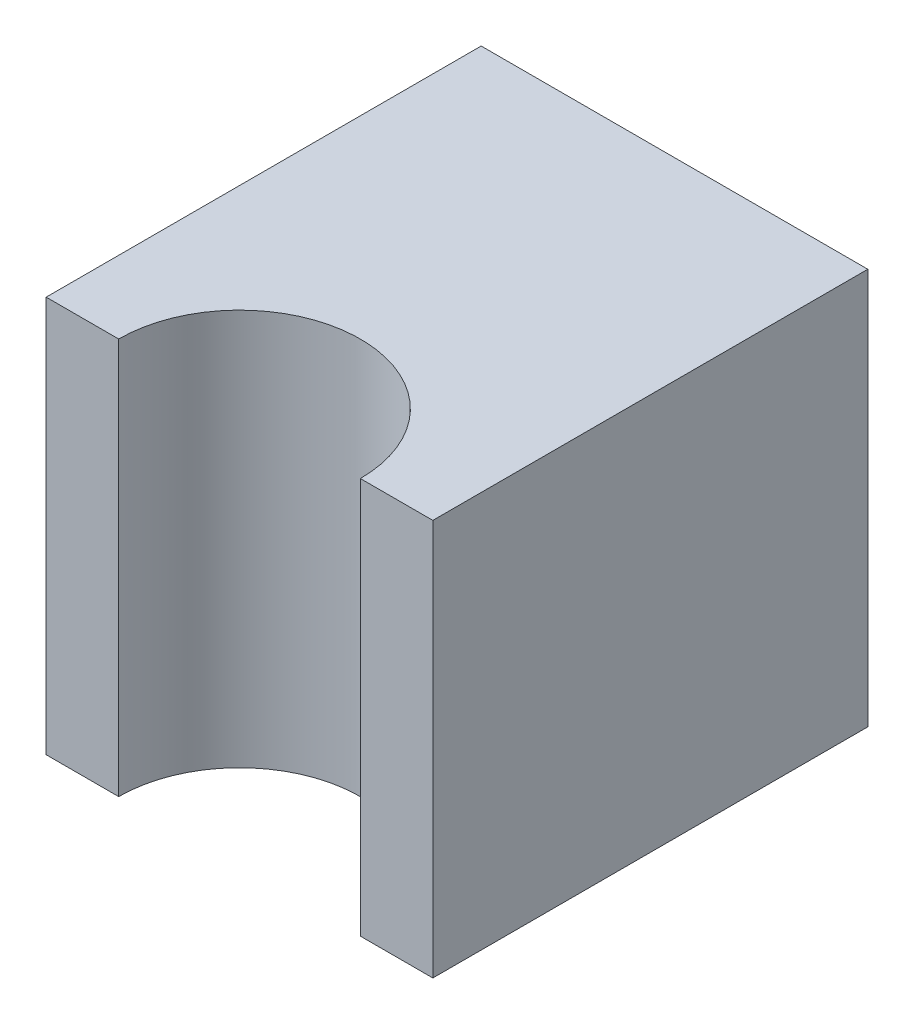
ISO-10303-21;
HEADER;
FILE_DESCRIPTION(('STEP AP214'),'2;1');
FILE_NAME('part.step','',(''),(''),'','','');
FILE_SCHEMA(('AUTOMOTIVE_DESIGN { 1 0 10303 214 1 1 1 1 }'));
ENDSEC;
DATA;
#1=APPLICATION_CONTEXT('core data for automotive mechanical design processes');
#2=APPLICATION_PROTOCOL_DEFINITION('international standard','automotive_design',2000,#1);
#3=PRODUCT_CONTEXT('',#1,'mechanical');
#4=PRODUCT('Part','Part','',(#3));
#5=PRODUCT_RELATED_PRODUCT_CATEGORY('part','',(#4));
#6=PRODUCT_DEFINITION_FORMATION('','',#4);
#7=PRODUCT_DEFINITION_CONTEXT('part definition',#1,'design');
#8=PRODUCT_DEFINITION('design','',#6,#7);
#9=PRODUCT_DEFINITION_SHAPE('','',#8);
#10=(LENGTH_UNIT() NAMED_UNIT(*) SI_UNIT(.MILLI.,.METRE.));
#11=(NAMED_UNIT(*) PLANE_ANGLE_UNIT() SI_UNIT($,.RADIAN.));
#12=(NAMED_UNIT(*) SI_UNIT($,.STERADIAN.) SOLID_ANGLE_UNIT());
#13=UNCERTAINTY_MEASURE_WITH_UNIT(LENGTH_MEASURE(1.E-05),#10,'distance_accuracy_value','');
#14=(GEOMETRIC_REPRESENTATION_CONTEXT(3) GLOBAL_UNCERTAINTY_ASSIGNED_CONTEXT((#13)) GLOBAL_UNIT_ASSIGNED_CONTEXT((#10,
#11,#12)) REPRESENTATION_CONTEXT('',''));
#15=CARTESIAN_POINT('',(0.,0.,0.));
#16=DIRECTION('',(0.,0.,1.));
#17=DIRECTION('',(1.,0.,0.));
#18=AXIS2_PLACEMENT_3D('',#15,#16,#17);
#19=CARTESIAN_POINT('',(1.75,0.,6.1));
#20=DIRECTION('',(0.,0.,1.));
#21=DIRECTION('',(1.,0.,0.));
#22=AXIS2_PLACEMENT_3D('',#19,#20,#21);
#23=PLANE('',#22);
#24=DIRECTION('',(1.,0.,0.));
#25=VECTOR('',#24,1.);
#26=CARTESIAN_POINT('',(1.5,0.82,6.1));
#27=LINE('',#26,#25);
#28=CARTESIAN_POINT('',(1.75,0.82,6.1));
#29=VERTEX_POINT('',#28);
#30=CARTESIAN_POINT('',(1.9,0.82,6.1));
#31=VERTEX_POINT('',#30);
#32=EDGE_CURVE('E76',#29,#31,#27,.T.);
#33=ORIENTED_EDGE('',*,*,#32,.F.);
#34=DIRECTION('',(0.,1.,0.));
#35=VECTOR('',#34,1.);
#36=CARTESIAN_POINT('',(1.75,0.,6.1));
#37=LINE('',#36,#35);
#38=CARTESIAN_POINT('',(1.75,0.,6.1));
#39=VERTEX_POINT('',#38);
#40=EDGE_CURVE('E72',#29,#39,#37,.F.);
#41=ORIENTED_EDGE('',*,*,#40,.T.);
#42=DIRECTION('',(1.,0.,0.));
#43=VECTOR('',#42,1.);
#44=CARTESIAN_POINT('',(1.5,0.,6.1));
#45=LINE('',#44,#43);
#46=CARTESIAN_POINT('',(1.9,0.,6.1));
#47=VERTEX_POINT('',#46);
#48=EDGE_CURVE('E73',#39,#47,#45,.T.);
#49=ORIENTED_EDGE('',*,*,#48,.T.);
#50=DIRECTION('',(0.,1.,0.));
#51=VECTOR('',#50,1.);
#52=CARTESIAN_POINT('',(1.9,0.,6.1));
#53=LINE('',#52,#51);
#54=EDGE_CURVE('E80',#31,#47,#53,.F.);
#55=ORIENTED_EDGE('',*,*,#54,.F.);
#56=EDGE_LOOP('',(#33,#41,#49,#55));
#57=FACE_BOUND('',#56,.T.);
#58=ADVANCED_FACE('F17',(#57),#23,.T.);
#59=CARTESIAN_POINT('',(1.5,0.,6.1));
#60=DIRECTION('',(0.,1.,0.));
#61=DIRECTION('',(0.,0.,1.));
#62=AXIS2_PLACEMENT_3D('',#59,#60,#61);
#63=CYLINDRICAL_SURFACE('',#62,0.25);
#64=ORIENTED_EDGE('',*,*,#40,.F.);
#65=CARTESIAN_POINT('',(1.5,0.82,6.1));
#66=DIRECTION('',(0.,1.,0.));
#67=DIRECTION('',(0.,0.,1.));
#68=AXIS2_PLACEMENT_3D('',#65,#66,#67);
#69=CIRCLE('',#68,0.25);
#70=CARTESIAN_POINT('',(1.25,0.82,6.1));
#71=VERTEX_POINT('',#70);
#72=EDGE_CURVE('E129',#71,#29,#69,.F.);
#73=ORIENTED_EDGE('',*,*,#72,.F.);
#74=DIRECTION('',(0.,1.,0.));
#75=VECTOR('',#74,1.);
#76=CARTESIAN_POINT('',(1.25,0.,6.1));
#77=LINE('',#76,#75);
#78=CARTESIAN_POINT('',(1.25,0.,6.1));
#79=VERTEX_POINT('',#78);
#80=EDGE_CURVE('E83',#79,#71,#77,.T.);
#81=ORIENTED_EDGE('',*,*,#80,.F.);
#82=CARTESIAN_POINT('',(1.5,0.,6.1));
#83=DIRECTION('',(0.,1.,0.));
#84=DIRECTION('',(0.,0.,1.));
#85=AXIS2_PLACEMENT_3D('',#82,#83,#84);
#86=CIRCLE('',#85,0.25);
#87=EDGE_CURVE('E20',#79,#39,#86,.F.);
#88=ORIENTED_EDGE('',*,*,#87,.T.);
#89=EDGE_LOOP('',(#64,#73,#81,#88));
#90=FACE_BOUND('',#89,.T.);
#91=ADVANCED_FACE('F82',(#90),#63,.F.);
#92=CARTESIAN_POINT('',(1.9,0.,6.1));
#93=DIRECTION('',(1.,0.,0.));
#94=DIRECTION('',(0.,0.,-1.));
#95=AXIS2_PLACEMENT_3D('',#92,#93,#94);
#96=PLANE('',#95);
#97=DIRECTION('',(0.,0.,1.));
#98=VECTOR('',#97,1.);
#99=CARTESIAN_POINT('',(1.9,0.82,5.65));
#100=LINE('',#99,#98);
#101=CARTESIAN_POINT('',(1.9,0.82,5.2));
#102=VERTEX_POINT('',#101);
#103=EDGE_CURVE('E108',#31,#102,#100,.F.);
#104=ORIENTED_EDGE('',*,*,#103,.F.);
#105=ORIENTED_EDGE('',*,*,#54,.T.);
#106=DIRECTION('',(0.,0.,1.));
#107=VECTOR('',#106,1.);
#108=CARTESIAN_POINT('',(1.9,0.,5.65));
#109=LINE('',#108,#107);
#110=CARTESIAN_POINT('',(1.9,0.,5.2));
#111=VERTEX_POINT('',#110);
#112=EDGE_CURVE('E85',#47,#111,#109,.F.);
#113=ORIENTED_EDGE('',*,*,#112,.T.);
#114=DIRECTION('',(0.,1.,0.));
#115=VECTOR('',#114,1.);
#116=CARTESIAN_POINT('',(1.9,0.,5.2));
#117=LINE('',#116,#115);
#118=EDGE_CURVE('E120',#102,#111,#117,.F.);
#119=ORIENTED_EDGE('',*,*,#118,.F.);
#120=EDGE_LOOP('',(#104,#105,#113,#119));
#121=FACE_BOUND('',#120,.T.);
#122=ADVANCED_FACE('F144',(#121),#96,.T.);
#123=CARTESIAN_POINT('',(1.5,0.,5.65));
#124=DIRECTION('',(0.,1.,0.));
#125=DIRECTION('',(0.,0.,1.));
#126=AXIS2_PLACEMENT_3D('',#123,#124,#125);
#127=PLANE('',#126);
#128=ORIENTED_EDGE('',*,*,#87,.F.);
#129=DIRECTION('',(1.,0.,0.));
#130=VECTOR('',#129,1.);
#131=CARTESIAN_POINT('',(1.1,0.,6.1));
#132=LINE('',#131,#130);
#133=CARTESIAN_POINT('',(1.1,0.,6.1));
#134=VERTEX_POINT('',#133);
#135=EDGE_CURVE('E88',#134,#79,#132,.T.);
#136=ORIENTED_EDGE('',*,*,#135,.F.);
#137=DIRECTION('',(0.,0.,1.));
#138=VECTOR('',#137,1.);
#139=CARTESIAN_POINT('',(1.1,0.,5.2));
#140=LINE('',#139,#138);
#141=CARTESIAN_POINT('',(1.1,0.,5.2));
#142=VERTEX_POINT('',#141);
#143=EDGE_CURVE('E105',#142,#134,#140,.T.);
#144=ORIENTED_EDGE('',*,*,#143,.F.);
#145=DIRECTION('',(-1.,0.,0.));
#146=VECTOR('',#145,1.);
#147=CARTESIAN_POINT('',(1.9,0.,5.2));
#148=LINE('',#147,#146);
#149=EDGE_CURVE('E126',#111,#142,#148,.T.);
#150=ORIENTED_EDGE('',*,*,#149,.F.);
#151=ORIENTED_EDGE('',*,*,#112,.F.);
#152=ORIENTED_EDGE('',*,*,#48,.F.);
#153=EDGE_LOOP('',(#128,#136,#144,#150,#151,#152));
#154=FACE_BOUND('',#153,.T.);
#155=ADVANCED_FACE('F86',(#154),#127,.F.);
#156=CARTESIAN_POINT('',(1.1,0.,6.1));
#157=DIRECTION('',(0.,0.,1.));
#158=DIRECTION('',(1.,0.,0.));
#159=AXIS2_PLACEMENT_3D('',#156,#157,#158);
#160=PLANE('',#159);
#161=DIRECTION('',(1.,0.,0.));
#162=VECTOR('',#161,1.);
#163=CARTESIAN_POINT('',(1.5,0.82,6.1));
#164=LINE('',#163,#162);
#165=CARTESIAN_POINT('',(1.1,0.82,6.1));
#166=VERTEX_POINT('',#165);
#167=EDGE_CURVE('E110',#166,#71,#164,.T.);
#168=ORIENTED_EDGE('',*,*,#167,.F.);
#169=DIRECTION('',(0.,1.,0.));
#170=VECTOR('',#169,1.);
#171=CARTESIAN_POINT('',(1.1,0.,6.1));
#172=LINE('',#171,#170);
#173=EDGE_CURVE('E100',#134,#166,#172,.T.);
#174=ORIENTED_EDGE('',*,*,#173,.F.);
#175=ORIENTED_EDGE('',*,*,#135,.T.);
#176=ORIENTED_EDGE('',*,*,#80,.T.);
#177=EDGE_LOOP('',(#168,#174,#175,#176));
#178=FACE_BOUND('',#177,.T.);
#179=ADVANCED_FACE('F151',(#178),#160,.T.);
#180=CARTESIAN_POINT('',(1.5,0.82,5.65));
#181=DIRECTION('',(0.,1.,0.));
#182=DIRECTION('',(0.,0.,1.));
#183=AXIS2_PLACEMENT_3D('',#180,#181,#182);
#184=PLANE('',#183);
#185=ORIENTED_EDGE('',*,*,#167,.T.);
#186=ORIENTED_EDGE('',*,*,#72,.T.);
#187=ORIENTED_EDGE('',*,*,#32,.T.);
#188=ORIENTED_EDGE('',*,*,#103,.T.);
#189=DIRECTION('',(-1.,0.,0.));
#190=VECTOR('',#189,1.);
#191=CARTESIAN_POINT('',(1.9,0.82,5.2));
#192=LINE('',#191,#190);
#193=CARTESIAN_POINT('',(1.1,0.82,5.2));
#194=VERTEX_POINT('',#193);
#195=EDGE_CURVE('E35',#194,#102,#192,.F.);
#196=ORIENTED_EDGE('',*,*,#195,.F.);
#197=DIRECTION('',(0.,0.,1.));
#198=VECTOR('',#197,1.);
#199=CARTESIAN_POINT('',(1.1,0.82,5.2));
#200=LINE('',#199,#198);
#201=EDGE_CURVE('E26',#166,#194,#200,.F.);
#202=ORIENTED_EDGE('',*,*,#201,.F.);
#203=EDGE_LOOP('',(#185,#186,#187,#188,#196,#202));
#204=FACE_BOUND('',#203,.T.);
#205=ADVANCED_FACE('F140',(#204),#184,.T.);
#206=CARTESIAN_POINT('',(1.9,0.,5.2));
#207=DIRECTION('',(0.,0.,-1.));
#208=DIRECTION('',(-1.,0.,0.));
#209=AXIS2_PLACEMENT_3D('',#206,#207,#208);
#210=PLANE('',#209);
#211=ORIENTED_EDGE('',*,*,#195,.T.);
#212=ORIENTED_EDGE('',*,*,#118,.T.);
#213=ORIENTED_EDGE('',*,*,#149,.T.);
#214=DIRECTION('',(0.,1.,0.));
#215=VECTOR('',#214,1.);
#216=CARTESIAN_POINT('',(1.1,0.,5.2));
#217=LINE('',#216,#215);
#218=EDGE_CURVE('E11',#194,#142,#217,.F.);
#219=ORIENTED_EDGE('',*,*,#218,.F.);
#220=EDGE_LOOP('',(#211,#212,#213,#219));
#221=FACE_BOUND('',#220,.T.);
#222=ADVANCED_FACE('F146',(#221),#210,.T.);
#223=CARTESIAN_POINT('',(1.1,0.,5.2));
#224=DIRECTION('',(-1.,0.,0.));
#225=DIRECTION('',(0.,0.,1.));
#226=AXIS2_PLACEMENT_3D('',#223,#224,#225);
#227=PLANE('',#226);
#228=ORIENTED_EDGE('',*,*,#201,.T.);
#229=ORIENTED_EDGE('',*,*,#218,.T.);
#230=ORIENTED_EDGE('',*,*,#143,.T.);
#231=ORIENTED_EDGE('',*,*,#173,.T.);
#232=EDGE_LOOP('',(#228,#229,#230,#231));
#233=FACE_BOUND('',#232,.T.);
#234=ADVANCED_FACE('F148',(#233),#227,.T.);
#235=CLOSED_SHELL('',(#58,#91,#122,#155,#179,#205,#222,#234));
#236=MANIFOLD_SOLID_BREP('B1',#235);
#237=ADVANCED_BREP_SHAPE_REPRESENTATION('',(#18,#236),#14);
#238=SHAPE_DEFINITION_REPRESENTATION(#9,#237);
ENDSEC;
END-ISO-10303-21;
